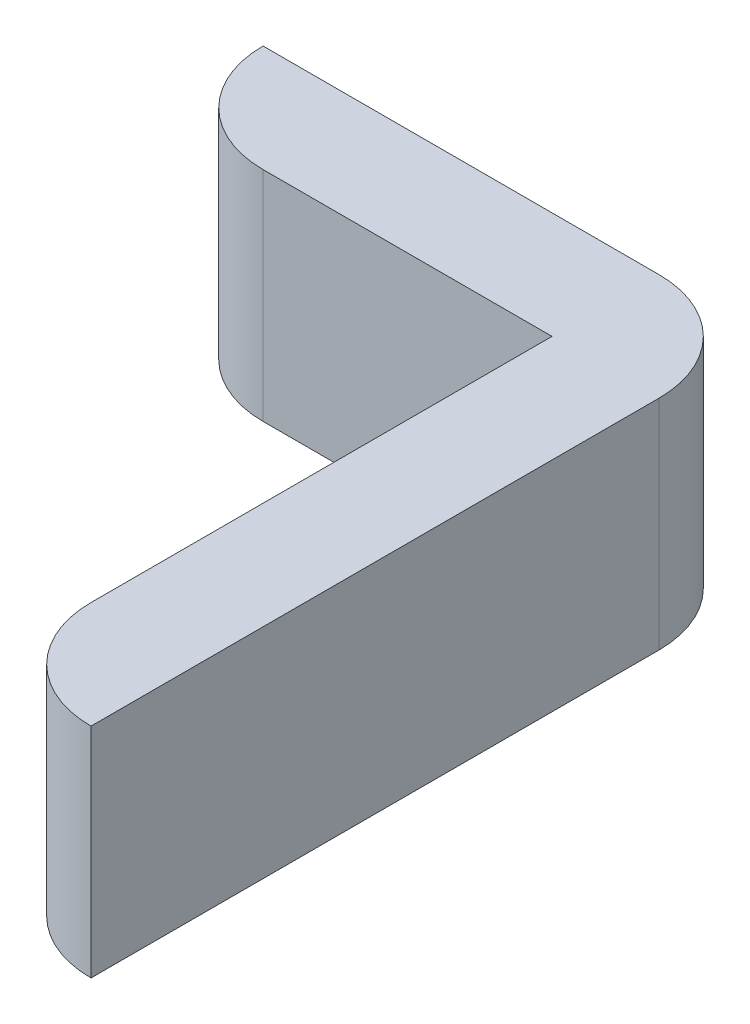
ISO-10303-21;
HEADER;
FILE_DESCRIPTION(('STEP AP214'),'2;1');
FILE_NAME('part.step','',(''),(''),'','','');
FILE_SCHEMA(('AUTOMOTIVE_DESIGN { 1 0 10303 214 1 1 1 1 }'));
ENDSEC;
DATA;
#1=APPLICATION_CONTEXT('core data for automotive mechanical design processes');
#2=APPLICATION_PROTOCOL_DEFINITION('international standard','automotive_design',2000,#1);
#3=PRODUCT_CONTEXT('',#1,'mechanical');
#4=PRODUCT('Part','Part','',(#3));
#5=PRODUCT_RELATED_PRODUCT_CATEGORY('part','',(#4));
#6=PRODUCT_DEFINITION_FORMATION('','',#4);
#7=PRODUCT_DEFINITION_CONTEXT('part definition',#1,'design');
#8=PRODUCT_DEFINITION('design','',#6,#7);
#9=PRODUCT_DEFINITION_SHAPE('','',#8);
#10=(LENGTH_UNIT() NAMED_UNIT(*) SI_UNIT(.MILLI.,.METRE.));
#11=(NAMED_UNIT(*) PLANE_ANGLE_UNIT() SI_UNIT($,.RADIAN.));
#12=(NAMED_UNIT(*) SI_UNIT($,.STERADIAN.) SOLID_ANGLE_UNIT());
#13=UNCERTAINTY_MEASURE_WITH_UNIT(LENGTH_MEASURE(1.E-05),#10,'distance_accuracy_value','');
#14=(GEOMETRIC_REPRESENTATION_CONTEXT(3) GLOBAL_UNCERTAINTY_ASSIGNED_CONTEXT((#13)) GLOBAL_UNIT_ASSIGNED_CONTEXT((#10,
#11,#12)) REPRESENTATION_CONTEXT('',''));
#15=CARTESIAN_POINT('',(0.,0.,0.));
#16=DIRECTION('',(0.,0.,1.));
#17=DIRECTION('',(1.,0.,0.));
#18=AXIS2_PLACEMENT_3D('',#15,#16,#17);
#19=CARTESIAN_POINT('',(9.275,-3.5552,0.));
#20=DIRECTION('',(0.,-1.,0.));
#21=DIRECTION('',(0.,0.,-1.));
#22=AXIS2_PLACEMENT_3D('',#19,#20,#21);
#23=PLANE('',#22);
#24=DIRECTION('',(-1.,0.,0.));
#25=VECTOR('',#24,1.);
#26=CARTESIAN_POINT('',(9.525,-3.5552,0.25));
#27=LINE('',#26,#25);
#28=CARTESIAN_POINT('',(9.525,-3.5552,0.25));
#29=VERTEX_POINT('',#28);
#30=CARTESIAN_POINT('',(10.2,-3.5552,0.25));
#31=VERTEX_POINT('',#30);
#32=EDGE_CURVE('E102',#29,#31,#27,.F.);
#33=ORIENTED_EDGE('',*,*,#32,.T.);
#34=DIRECTION('',(0.,0.,-1.));
#35=VECTOR('',#34,1.);
#36=CARTESIAN_POINT('',(10.2,-3.5552,0.25));
#37=LINE('',#36,#35);
#38=CARTESIAN_POINT('',(10.2,-3.5552,1.327));
#39=VERTEX_POINT('',#38);
#40=EDGE_CURVE('E108',#31,#39,#37,.F.);
#41=ORIENTED_EDGE('',*,*,#40,.T.);
#42=CARTESIAN_POINT('',(10.45,-3.5552,1.327));
#43=DIRECTION('',(0.,-1.,0.));
#44=DIRECTION('',(0.,0.,-1.));
#45=AXIS2_PLACEMENT_3D('',#42,#43,#44);
#46=CIRCLE('',#45,0.25);
#47=CARTESIAN_POINT('',(10.45,-3.5552,1.577));
#48=VERTEX_POINT('',#47);
#49=EDGE_CURVE('E80',#48,#39,#46,.T.);
#50=ORIENTED_EDGE('',*,*,#49,.F.);
#51=DIRECTION('',(0.,0.,1.));
#52=VECTOR('',#51,1.);
#53=CARTESIAN_POINT('',(10.45,-3.5552,1.577));
#54=LINE('',#53,#52);
#55=CARTESIAN_POINT('',(10.45,-3.5552,0.25));
#56=VERTEX_POINT('',#55);
#57=EDGE_CURVE('E75',#48,#56,#54,.F.);
#58=ORIENTED_EDGE('',*,*,#57,.T.);
#59=CARTESIAN_POINT('',(10.2,-3.5552,0.25));
#60=DIRECTION('',(0.,-1.,0.));
#61=DIRECTION('',(0.,0.,-1.));
#62=AXIS2_PLACEMENT_3D('',#59,#60,#61);
#63=CIRCLE('',#62,0.25);
#64=CARTESIAN_POINT('',(10.2,-3.5552,0.));
#65=VERTEX_POINT('',#64);
#66=EDGE_CURVE('E19',#65,#56,#63,.T.);
#67=ORIENTED_EDGE('',*,*,#66,.F.);
#68=DIRECTION('',(1.,0.,0.));
#69=VECTOR('',#68,1.);
#70=CARTESIAN_POINT('',(10.2,-3.5552,0.));
#71=LINE('',#70,#69);
#72=CARTESIAN_POINT('',(9.275,-3.5552,0.));
#73=VERTEX_POINT('',#72);
#74=EDGE_CURVE('E70',#65,#73,#71,.F.);
#75=ORIENTED_EDGE('',*,*,#74,.T.);
#76=CARTESIAN_POINT('',(9.525,-3.5552,0.));
#77=DIRECTION('',(0.,-1.,0.));
#78=DIRECTION('',(0.,0.,-1.));
#79=AXIS2_PLACEMENT_3D('',#76,#77,#78);
#80=CIRCLE('',#79,0.25);
#81=EDGE_CURVE('E121',#29,#73,#80,.T.);
#82=ORIENTED_EDGE('',*,*,#81,.F.);
#83=EDGE_LOOP('',(#33,#41,#50,#58,#67,#75,#82));
#84=FACE_BOUND('',#83,.T.);
#85=ADVANCED_FACE('F16',(#84),#23,.F.);
#86=CARTESIAN_POINT('',(10.2,-4.0648,0.));
#87=DIRECTION('',(0.,0.,1.));
#88=DIRECTION('',(1.,0.,0.));
#89=AXIS2_PLACEMENT_3D('',#86,#87,#88);
#90=PLANE('',#89);
#91=DIRECTION('',(0.,-1.,0.));
#92=VECTOR('',#91,1.);
#93=CARTESIAN_POINT('',(9.275,-4.0648,0.));
#94=LINE('',#93,#92);
#95=CARTESIAN_POINT('',(9.275,-4.0648,0.));
#96=VERTEX_POINT('',#95);
#97=EDGE_CURVE('E123',#73,#96,#94,.T.);
#98=ORIENTED_EDGE('',*,*,#97,.F.);
#99=ORIENTED_EDGE('',*,*,#74,.F.);
#100=DIRECTION('',(0.,-1.,0.));
#101=VECTOR('',#100,1.);
#102=CARTESIAN_POINT('',(10.2,-4.0648,0.));
#103=LINE('',#102,#101);
#104=CARTESIAN_POINT('',(10.2,-4.0648,0.));
#105=VERTEX_POINT('',#104);
#106=EDGE_CURVE('E92',#105,#65,#103,.F.);
#107=ORIENTED_EDGE('',*,*,#106,.F.);
#108=DIRECTION('',(1.,0.,0.));
#109=VECTOR('',#108,1.);
#110=CARTESIAN_POINT('',(9.275,-4.0648,0.));
#111=LINE('',#110,#109);
#112=EDGE_CURVE('E120',#96,#105,#111,.T.);
#113=ORIENTED_EDGE('',*,*,#112,.F.);
#114=EDGE_LOOP('',(#98,#99,#107,#113));
#115=FACE_BOUND('',#114,.T.);
#116=ADVANCED_FACE('F158',(#115),#90,.F.);
#117=CARTESIAN_POINT('',(10.2,-4.0648,0.25));
#118=DIRECTION('',(0.,-1.,0.));
#119=DIRECTION('',(0.,0.,-1.));
#120=AXIS2_PLACEMENT_3D('',#117,#118,#119);
#121=CYLINDRICAL_SURFACE('',#120,0.25);
#122=ORIENTED_EDGE('',*,*,#66,.T.);
#123=DIRECTION('',(0.,1.,0.));
#124=VECTOR('',#123,1.);
#125=CARTESIAN_POINT('',(10.45,-4.0648,0.25));
#126=LINE('',#125,#124);
#127=CARTESIAN_POINT('',(10.45,-4.0648,0.25));
#128=VERTEX_POINT('',#127);
#129=EDGE_CURVE('E86',#56,#128,#126,.F.);
#130=ORIENTED_EDGE('',*,*,#129,.T.);
#131=CARTESIAN_POINT('',(10.2,-4.0648,0.25));
#132=DIRECTION('',(0.,-1.,0.));
#133=DIRECTION('',(0.,0.,-1.));
#134=AXIS2_PLACEMENT_3D('',#131,#132,#133);
#135=CIRCLE('',#134,0.25);
#136=EDGE_CURVE('E118',#105,#128,#135,.T.);
#137=ORIENTED_EDGE('',*,*,#136,.F.);
#138=ORIENTED_EDGE('',*,*,#106,.T.);
#139=EDGE_LOOP('',(#122,#130,#137,#138));
#140=FACE_BOUND('',#139,.T.);
#141=ADVANCED_FACE('F89',(#140),#121,.T.);
#142=CARTESIAN_POINT('',(10.45,-4.0648,1.577));
#143=DIRECTION('',(-1.,0.,0.));
#144=DIRECTION('',(0.,0.,1.));
#145=AXIS2_PLACEMENT_3D('',#142,#143,#144);
#146=PLANE('',#145);
#147=DIRECTION('',(0.,-1.,0.));
#148=VECTOR('',#147,1.);
#149=CARTESIAN_POINT('',(10.45,-4.0648,1.577));
#150=LINE('',#149,#148);
#151=CARTESIAN_POINT('',(10.45,-4.0648,1.577));
#152=VERTEX_POINT('',#151);
#153=EDGE_CURVE('E85',#152,#48,#150,.F.);
#154=ORIENTED_EDGE('',*,*,#153,.F.);
#155=DIRECTION('',(0.,0.,-1.));
#156=VECTOR('',#155,1.);
#157=CARTESIAN_POINT('',(10.45,-4.0648,0.));
#158=LINE('',#157,#156);
#159=EDGE_CURVE('E94',#128,#152,#158,.F.);
#160=ORIENTED_EDGE('',*,*,#159,.F.);
#161=ORIENTED_EDGE('',*,*,#129,.F.);
#162=ORIENTED_EDGE('',*,*,#57,.F.);
#163=EDGE_LOOP('',(#154,#160,#161,#162));
#164=FACE_BOUND('',#163,.T.);
#165=ADVANCED_FACE('F93',(#164),#146,.F.);
#166=CARTESIAN_POINT('',(10.45,-4.0648,1.327));
#167=DIRECTION('',(0.,-1.,0.));
#168=DIRECTION('',(0.,0.,-1.));
#169=AXIS2_PLACEMENT_3D('',#166,#167,#168);
#170=CYLINDRICAL_SURFACE('',#169,0.25);
#171=ORIENTED_EDGE('',*,*,#49,.T.);
#172=DIRECTION('',(0.,1.,0.));
#173=VECTOR('',#172,1.);
#174=CARTESIAN_POINT('',(10.2,-4.0648,1.327));
#175=LINE('',#174,#173);
#176=CARTESIAN_POINT('',(10.2,-4.0648,1.327));
#177=VERTEX_POINT('',#176);
#178=EDGE_CURVE('E105',#39,#177,#175,.F.);
#179=ORIENTED_EDGE('',*,*,#178,.T.);
#180=CARTESIAN_POINT('',(10.45,-4.0648,1.327));
#181=DIRECTION('',(0.,-1.,0.));
#182=DIRECTION('',(0.,0.,-1.));
#183=AXIS2_PLACEMENT_3D('',#180,#181,#182);
#184=CIRCLE('',#183,0.25);
#185=EDGE_CURVE('E114',#152,#177,#184,.T.);
#186=ORIENTED_EDGE('',*,*,#185,.F.);
#187=ORIENTED_EDGE('',*,*,#153,.T.);
#188=EDGE_LOOP('',(#171,#179,#186,#187));
#189=FACE_BOUND('',#188,.T.);
#190=ADVANCED_FACE('F127',(#189),#170,.T.);
#191=CARTESIAN_POINT('',(10.2,-4.0648,0.25));
#192=DIRECTION('',(1.,0.,0.));
#193=DIRECTION('',(0.,0.,-1.));
#194=AXIS2_PLACEMENT_3D('',#191,#192,#193);
#195=PLANE('',#194);
#196=ORIENTED_EDGE('',*,*,#178,.F.);
#197=ORIENTED_EDGE('',*,*,#40,.F.);
#198=DIRECTION('',(0.,1.,0.));
#199=VECTOR('',#198,1.);
#200=CARTESIAN_POINT('',(10.2,-4.0648,0.25));
#201=LINE('',#200,#199);
#202=CARTESIAN_POINT('',(10.2,-4.0648,0.25));
#203=VERTEX_POINT('',#202);
#204=EDGE_CURVE('E104',#31,#203,#201,.F.);
#205=ORIENTED_EDGE('',*,*,#204,.T.);
#206=DIRECTION('',(0.,0.,-1.));
#207=VECTOR('',#206,1.);
#208=CARTESIAN_POINT('',(10.2,-4.0648,0.));
#209=LINE('',#208,#207);
#210=EDGE_CURVE('E117',#177,#203,#209,.T.);
#211=ORIENTED_EDGE('',*,*,#210,.F.);
#212=EDGE_LOOP('',(#196,#197,#205,#211));
#213=FACE_BOUND('',#212,.T.);
#214=ADVANCED_FACE('F150',(#213),#195,.F.);
#215=CARTESIAN_POINT('',(9.525,-4.0648,0.25));
#216=DIRECTION('',(0.,0.,-1.));
#217=DIRECTION('',(-1.,0.,0.));
#218=AXIS2_PLACEMENT_3D('',#215,#216,#217);
#219=PLANE('',#218);
#220=ORIENTED_EDGE('',*,*,#204,.F.);
#221=ORIENTED_EDGE('',*,*,#32,.F.);
#222=DIRECTION('',(0.,-1.,0.));
#223=VECTOR('',#222,1.);
#224=CARTESIAN_POINT('',(9.525,-4.0648,0.25));
#225=LINE('',#224,#223);
#226=CARTESIAN_POINT('',(9.525,-4.0648,0.25));
#227=VERTEX_POINT('',#226);
#228=EDGE_CURVE('E34',#227,#29,#225,.F.);
#229=ORIENTED_EDGE('',*,*,#228,.F.);
#230=DIRECTION('',(1.,0.,0.));
#231=VECTOR('',#230,1.);
#232=CARTESIAN_POINT('',(9.275,-4.0648,0.25));
#233=LINE('',#232,#231);
#234=EDGE_CURVE('E25',#203,#227,#233,.F.);
#235=ORIENTED_EDGE('',*,*,#234,.F.);
#236=EDGE_LOOP('',(#220,#221,#229,#235));
#237=FACE_BOUND('',#236,.T.);
#238=ADVANCED_FACE('F151',(#237),#219,.F.);
#239=CARTESIAN_POINT('',(9.525,-4.0648,0.));
#240=DIRECTION('',(0.,-1.,0.));
#241=DIRECTION('',(0.,0.,-1.));
#242=AXIS2_PLACEMENT_3D('',#239,#240,#241);
#243=CYLINDRICAL_SURFACE('',#242,0.25);
#244=ORIENTED_EDGE('',*,*,#81,.T.);
#245=ORIENTED_EDGE('',*,*,#97,.T.);
#246=CARTESIAN_POINT('',(9.525,-4.0648,0.));
#247=DIRECTION('',(0.,-1.,0.));
#248=DIRECTION('',(0.,0.,-1.));
#249=AXIS2_PLACEMENT_3D('',#246,#247,#248);
#250=CIRCLE('',#249,0.25);
#251=EDGE_CURVE('E11',#227,#96,#250,.T.);
#252=ORIENTED_EDGE('',*,*,#251,.F.);
#253=ORIENTED_EDGE('',*,*,#228,.T.);
#254=EDGE_LOOP('',(#244,#245,#252,#253));
#255=FACE_BOUND('',#254,.T.);
#256=ADVANCED_FACE('F156',(#255),#243,.T.);
#257=CARTESIAN_POINT('',(9.275,-4.0648,0.));
#258=DIRECTION('',(0.,-1.,0.));
#259=DIRECTION('',(0.,0.,-1.));
#260=AXIS2_PLACEMENT_3D('',#257,#258,#259);
#261=PLANE('',#260);
#262=ORIENTED_EDGE('',*,*,#234,.T.);
#263=ORIENTED_EDGE('',*,*,#251,.T.);
#264=ORIENTED_EDGE('',*,*,#112,.T.);
#265=ORIENTED_EDGE('',*,*,#136,.T.);
#266=ORIENTED_EDGE('',*,*,#159,.T.);
#267=ORIENTED_EDGE('',*,*,#185,.T.);
#268=ORIENTED_EDGE('',*,*,#210,.T.);
#269=EDGE_LOOP('',(#262,#263,#264,#265,#266,#267,#268));
#270=FACE_BOUND('',#269,.T.);
#271=ADVANCED_FACE('F132',(#270),#261,.T.);
#272=CLOSED_SHELL('',(#85,#116,#141,#165,#190,#214,#238,#256,#271));
#273=MANIFOLD_SOLID_BREP('B1',#272);
#274=ADVANCED_BREP_SHAPE_REPRESENTATION('',(#18,#273),#14);
#275=SHAPE_DEFINITION_REPRESENTATION(#9,#274);
ENDSEC;
END-ISO-10303-21;
